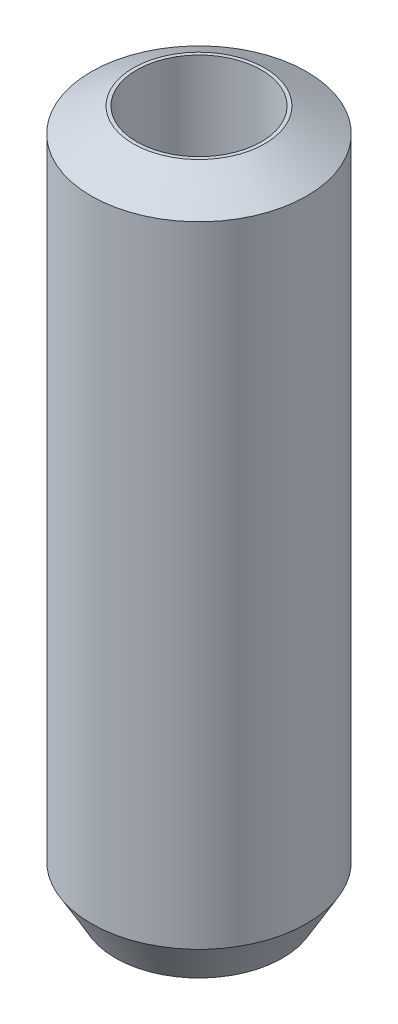
ISO-10303-21;
HEADER;
FILE_DESCRIPTION(('STEP AP214'),'2;1');
FILE_NAME('part.step','',(''),(''),'','','');
FILE_SCHEMA(('AUTOMOTIVE_DESIGN { 1 0 10303 214 1 1 1 1 }'));
ENDSEC;
DATA;
#1=APPLICATION_CONTEXT('core data for automotive mechanical design processes');
#2=APPLICATION_PROTOCOL_DEFINITION('international standard','automotive_design',2000,#1);
#3=PRODUCT_CONTEXT('',#1,'mechanical');
#4=PRODUCT('Part','Part','',(#3));
#5=PRODUCT_RELATED_PRODUCT_CATEGORY('part','',(#4));
#6=PRODUCT_DEFINITION_FORMATION('','',#4);
#7=PRODUCT_DEFINITION_CONTEXT('part definition',#1,'design');
#8=PRODUCT_DEFINITION('design','',#6,#7);
#9=PRODUCT_DEFINITION_SHAPE('','',#8);
#10=(LENGTH_UNIT() NAMED_UNIT(*) SI_UNIT(.MILLI.,.METRE.));
#11=(NAMED_UNIT(*) PLANE_ANGLE_UNIT() SI_UNIT($,.RADIAN.));
#12=(NAMED_UNIT(*) SI_UNIT($,.STERADIAN.) SOLID_ANGLE_UNIT());
#13=UNCERTAINTY_MEASURE_WITH_UNIT(LENGTH_MEASURE(1.E-05),#10,'distance_accuracy_value','');
#14=(GEOMETRIC_REPRESENTATION_CONTEXT(3) GLOBAL_UNCERTAINTY_ASSIGNED_CONTEXT((#13)) GLOBAL_UNIT_ASSIGNED_CONTEXT((#10,
#11,#12)) REPRESENTATION_CONTEXT('',''));
#15=CARTESIAN_POINT('',(0.,0.,0.));
#16=DIRECTION('',(0.,0.,1.));
#17=DIRECTION('',(1.,0.,0.));
#18=AXIS2_PLACEMENT_3D('',#15,#16,#17);
#19=CARTESIAN_POINT('',(0.,80.7942248856656,0.));
#20=DIRECTION('',(0.,-1.,0.));
#21=DIRECTION('',(0.,0.,-1.));
#22=AXIS2_PLACEMENT_3D('',#19,#20,#21);
#23=CYLINDRICAL_SURFACE('',#22,12.5);
#24=CARTESIAN_POINT('',(0.,77.9827963178501,0.));
#25=DIRECTION('',(0.,1.,0.));
#26=DIRECTION('',(0.,0.,1.));
#27=AXIS2_PLACEMENT_3D('',#24,#25,#26);
#28=CIRCLE('',#27,12.5);
#29=CARTESIAN_POINT('',(0.,77.9827963178501,12.5));
#30=VERTEX_POINT('',#29);
#31=EDGE_CURVE('E50',#30,#30,#28,.F.);
#32=ORIENTED_EDGE('',*,*,#31,.T.);
#33=EDGE_LOOP('',(#32));
#34=FACE_BOUND('',#33,.T.);
#35=CARTESIAN_POINT('',(0.,4.86953712130704,0.));
#36=DIRECTION('',(0.,1.,0.));
#37=DIRECTION('',(0.,0.,1.));
#38=AXIS2_PLACEMENT_3D('',#35,#36,#37);
#39=CIRCLE('',#38,12.5);
#40=CARTESIAN_POINT('',(0.,4.86953712130704,12.5));
#41=VERTEX_POINT('',#40);
#42=EDGE_CURVE('E51',#41,#41,#39,.T.);
#43=ORIENTED_EDGE('',*,*,#42,.T.);
#44=EDGE_LOOP('',(#43));
#45=FACE_BOUND('',#44,.T.);
#46=ADVANCED_FACE('F39',(#34,#45),#23,.T.);
#47=CARTESIAN_POINT('',(0.,80.7942248856656,0.));
#48=DIRECTION('',(0.,1.,0.));
#49=DIRECTION('',(0.,0.,1.));
#50=AXIS2_PLACEMENT_3D('',#47,#48,#49);
#51=PLANE('',#50);
#52=CARTESIAN_POINT('',(0.,80.7942248856656,0.));
#53=DIRECTION('',(0.,1.,0.));
#54=DIRECTION('',(0.,0.,1.));
#55=AXIS2_PLACEMENT_3D('',#52,#53,#54);
#56=CIRCLE('',#55,7.630462878693);
#57=CARTESIAN_POINT('',(0.,80.7942248856656,7.630462878693));
#58=VERTEX_POINT('',#57);
#59=EDGE_CURVE('E54',#58,#58,#56,.T.);
#60=ORIENTED_EDGE('',*,*,#59,.T.);
#61=EDGE_LOOP('',(#60));
#62=FACE_BOUND('',#61,.T.);
#63=CARTESIAN_POINT('',(0.,80.7942248856656,0.));
#64=DIRECTION('',(0.,1.,0.));
#65=DIRECTION('',(0.,0.,1.));
#66=AXIS2_PLACEMENT_3D('',#63,#64,#65);
#67=CIRCLE('',#66,7.23057103933768);
#68=CARTESIAN_POINT('',(0.,80.7942248856656,7.23057103933768));
#69=VERTEX_POINT('',#68);
#70=EDGE_CURVE('E58',#69,#69,#67,.T.);
#71=ORIENTED_EDGE('',*,*,#70,.F.);
#72=EDGE_LOOP('',(#71));
#73=FACE_BOUND('',#72,.T.);
#74=ADVANCED_FACE('F69',(#62,#73),#51,.T.);
#75=CARTESIAN_POINT('',(0.,0.,0.));
#76=DIRECTION('',(0.,1.,0.));
#77=DIRECTION('',(0.,0.,1.));
#78=AXIS2_PLACEMENT_3D('',#75,#76,#77);
#79=PLANE('',#78);
#80=CARTESIAN_POINT('',(0.,0.,0.));
#81=DIRECTION('',(0.,1.,0.));
#82=DIRECTION('',(0.,0.,1.));
#83=AXIS2_PLACEMENT_3D('',#80,#81,#82);
#84=CIRCLE('',#83,9.68857143218449);
#85=CARTESIAN_POINT('',(0.,0.,9.68857143218449));
#86=VERTEX_POINT('',#85);
#87=EDGE_CURVE('E10',#86,#86,#84,.F.);
#88=ORIENTED_EDGE('',*,*,#87,.T.);
#89=EDGE_LOOP('',(#88));
#90=FACE_BOUND('',#89,.T.);
#91=CARTESIAN_POINT('',(0.,0.,0.));
#92=DIRECTION('',(0.,1.,0.));
#93=DIRECTION('',(0.,0.,1.));
#94=AXIS2_PLACEMENT_3D('',#91,#92,#93);
#95=CIRCLE('',#94,7.23057103933768);
#96=CARTESIAN_POINT('',(0.,0.,7.23057103933768));
#97=VERTEX_POINT('',#96);
#98=EDGE_CURVE('E63',#97,#97,#95,.T.);
#99=ORIENTED_EDGE('',*,*,#98,.T.);
#100=EDGE_LOOP('',(#99));
#101=FACE_BOUND('',#100,.T.);
#102=ADVANCED_FACE('F75',(#90,#101),#79,.F.);
#103=CARTESIAN_POINT('',(0.,80.7942248856656,0.));
#104=DIRECTION('',(0.,-1.,0.));
#105=DIRECTION('',(0.,0.,-1.));
#106=AXIS2_PLACEMENT_3D('',#103,#104,#105);
#107=CYLINDRICAL_SURFACE('',#106,7.23057103933768);
#108=ORIENTED_EDGE('',*,*,#70,.T.);
#109=EDGE_LOOP('',(#108));
#110=FACE_BOUND('',#109,.T.);
#111=ORIENTED_EDGE('',*,*,#98,.F.);
#112=EDGE_LOOP('',(#111));
#113=FACE_BOUND('',#112,.T.);
#114=ADVANCED_FACE('F70',(#110,#113),#107,.F.);
#115=CARTESIAN_POINT('',(0.,80.7942248856656,0.));
#116=DIRECTION('',(0.,-1.,0.));
#117=DIRECTION('',(0.,0.,-1.));
#118=AXIS2_PLACEMENT_3D('',#115,#116,#117);
#119=CONICAL_SURFACE('',#118,7.630462878693,1.04719755119659);
#120=ORIENTED_EDGE('',*,*,#31,.F.);
#121=EDGE_LOOP('',(#120));
#122=FACE_BOUND('',#121,.T.);
#123=ORIENTED_EDGE('',*,*,#59,.F.);
#124=EDGE_LOOP('',(#123));
#125=FACE_BOUND('',#124,.T.);
#126=ADVANCED_FACE('F81',(#122,#125),#119,.T.);
#127=CARTESIAN_POINT('',(0.,4.86953712130704,0.));
#128=DIRECTION('',(0.,1.,0.));
#129=DIRECTION('',(0.,0.,1.));
#130=AXIS2_PLACEMENT_3D('',#127,#128,#129);
#131=CONICAL_SURFACE('',#130,12.5,0.523598775598301);
#132=ORIENTED_EDGE('',*,*,#87,.F.);
#133=EDGE_LOOP('',(#132));
#134=FACE_BOUND('',#133,.T.);
#135=ORIENTED_EDGE('',*,*,#42,.F.);
#136=EDGE_LOOP('',(#135));
#137=FACE_BOUND('',#136,.T.);
#138=ADVANCED_FACE('F45',(#134,#137),#131,.T.);
#139=CLOSED_SHELL('',(#46,#74,#102,#114,#126,#138));
#140=MANIFOLD_SOLID_BREP('B2',#139);
#141=ADVANCED_BREP_SHAPE_REPRESENTATION('',(#18,#140),#14);
#142=SHAPE_DEFINITION_REPRESENTATION(#9,#141);
ENDSEC;
END-ISO-10303-21;
